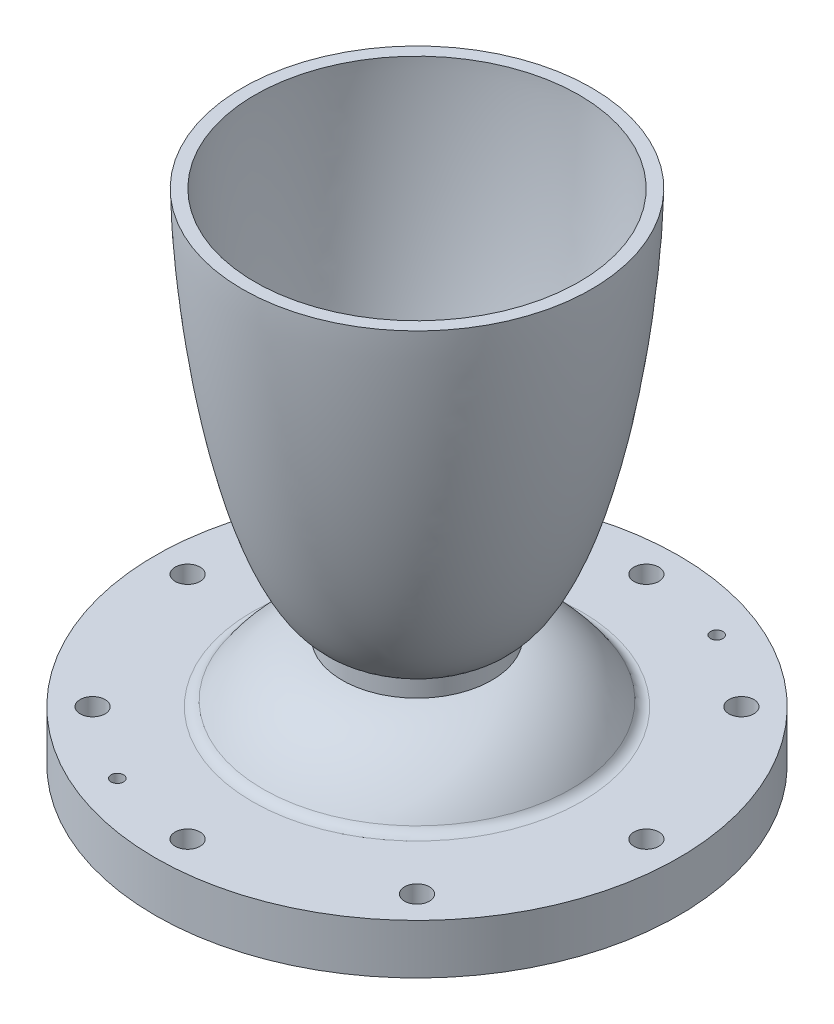
ISO-10303-21;
HEADER;
FILE_DESCRIPTION(('STEP AP214'),'2;1');
FILE_NAME('part.step','',(''),(''),'','','');
FILE_SCHEMA(('AUTOMOTIVE_DESIGN { 1 0 10303 214 1 1 1 1 }'));
ENDSEC;
DATA;
#1=APPLICATION_CONTEXT('core data for automotive mechanical design processes');
#2=APPLICATION_PROTOCOL_DEFINITION('international standard','automotive_design',2000,#1);
#3=PRODUCT_CONTEXT('',#1,'mechanical');
#4=PRODUCT('Part','Part','',(#3));
#5=PRODUCT_RELATED_PRODUCT_CATEGORY('part','',(#4));
#6=PRODUCT_DEFINITION_FORMATION('','',#4);
#7=PRODUCT_DEFINITION_CONTEXT('part definition',#1,'design');
#8=PRODUCT_DEFINITION('design','',#6,#7);
#9=PRODUCT_DEFINITION_SHAPE('','',#8);
#10=(LENGTH_UNIT() NAMED_UNIT(*) SI_UNIT(.MILLI.,.METRE.));
#11=(NAMED_UNIT(*) PLANE_ANGLE_UNIT() SI_UNIT($,.RADIAN.));
#12=(NAMED_UNIT(*) SI_UNIT($,.STERADIAN.) SOLID_ANGLE_UNIT());
#13=UNCERTAINTY_MEASURE_WITH_UNIT(LENGTH_MEASURE(1.E-05),#10,'distance_accuracy_value','');
#14=(GEOMETRIC_REPRESENTATION_CONTEXT(3) GLOBAL_UNCERTAINTY_ASSIGNED_CONTEXT((#13)) GLOBAL_UNIT_ASSIGNED_CONTEXT((#10,
#11,#12)) REPRESENTATION_CONTEXT('',''));
#15=CARTESIAN_POINT('',(0.,0.,0.));
#16=DIRECTION('',(0.,0.,1.));
#17=DIRECTION('',(1.,0.,0.));
#18=AXIS2_PLACEMENT_3D('',#15,#16,#17);
#19=CARTESIAN_POINT('',(-66.675,12.7,0.));
#20=DIRECTION('',(0.,-1.,0.));
#21=DIRECTION('',(0.,0.,-1.));
#22=AXIS2_PLACEMENT_3D('',#19,#20,#21);
#23=PLANE('',#22);
#24=CARTESIAN_POINT('',(22.3563661187686,12.7,-53.9730422893094));
#25=DIRECTION('',(0.,-1.,0.));
#26=DIRECTION('',(0.,0.,-1.));
#27=AXIS2_PLACEMENT_3D('',#24,#25,#26);
#28=CIRCLE('',#27,1.58750000000001);
#29=CARTESIAN_POINT('',(22.3563661187686,12.7,-55.5605422893094));
#30=VERTEX_POINT('',#29);
#31=EDGE_CURVE('E41',#30,#30,#28,.T.);
#32=ORIENTED_EDGE('',*,*,#31,.T.);
#33=EDGE_LOOP('',(#32));
#34=FACE_BOUND('',#33,.T.);
#35=CARTESIAN_POINT('',(-22.3563661187682,12.7,53.9730422893095));
#36=DIRECTION('',(0.,-1.,0.));
#37=DIRECTION('',(0.,0.,-1.));
#38=AXIS2_PLACEMENT_3D('',#35,#36,#37);
#39=CIRCLE('',#38,1.58750000000001);
#40=CARTESIAN_POINT('',(-22.3563661187682,12.7,52.3855422893095));
#41=VERTEX_POINT('',#40);
#42=EDGE_CURVE('E55',#41,#41,#39,.T.);
#43=ORIENTED_EDGE('',*,*,#42,.T.);
#44=EDGE_LOOP('',(#43));
#45=FACE_BOUND('',#44,.T.);
#46=CARTESIAN_POINT('',(-58.42,12.7,0.));
#47=DIRECTION('',(0.,1.,0.));
#48=DIRECTION('',(0.,0.,1.));
#49=AXIS2_PLACEMENT_3D('',#46,#47,#48);
#50=CIRCLE('',#49,3.175);
#51=CARTESIAN_POINT('',(-58.42,12.7,3.175));
#52=VERTEX_POINT('',#51);
#53=EDGE_CURVE('E58',#52,#52,#50,.T.);
#54=ORIENTED_EDGE('',*,*,#53,.F.);
#55=EDGE_LOOP('',(#54));
#56=FACE_BOUND('',#55,.T.);
#57=CARTESIAN_POINT('',(2.03972339815216E-13,12.7,-58.42));
#58=DIRECTION('',(0.,1.,0.));
#59=DIRECTION('',(0.,0.,1.));
#60=AXIS2_PLACEMENT_3D('',#57,#58,#59);
#61=CIRCLE('',#60,3.175);
#62=CARTESIAN_POINT('',(2.03972339815216E-13,12.7,-55.245));
#63=VERTEX_POINT('',#62);
#64=EDGE_CURVE('E89',#63,#63,#61,.T.);
#65=ORIENTED_EDGE('',*,*,#64,.F.);
#66=EDGE_LOOP('',(#65));
#67=FACE_BOUND('',#66,.T.);
#68=CARTESIAN_POINT('',(41.3091781569183,12.7,-41.3091781569179));
#69=DIRECTION('',(0.,1.,0.));
#70=DIRECTION('',(0.,0.,1.));
#71=AXIS2_PLACEMENT_3D('',#68,#69,#70);
#72=CIRCLE('',#71,3.175);
#73=CARTESIAN_POINT('',(41.3091781569183,12.7,-38.1341781569179));
#74=VERTEX_POINT('',#73);
#75=EDGE_CURVE('E97',#74,#74,#72,.T.);
#76=ORIENTED_EDGE('',*,*,#75,.F.);
#77=EDGE_LOOP('',(#76));
#78=FACE_BOUND('',#77,.T.);
#79=CARTESIAN_POINT('',(58.42,12.7,4.07944679630432E-13));
#80=DIRECTION('',(0.,1.,0.));
#81=DIRECTION('',(0.,0.,1.));
#82=AXIS2_PLACEMENT_3D('',#79,#80,#81);
#83=CIRCLE('',#82,3.175);
#84=CARTESIAN_POINT('',(58.42,12.7,3.17500000000041));
#85=VERTEX_POINT('',#84);
#86=EDGE_CURVE('E105',#85,#85,#83,.T.);
#87=ORIENTED_EDGE('',*,*,#86,.F.);
#88=EDGE_LOOP('',(#87));
#89=FACE_BOUND('',#88,.T.);
#90=CARTESIAN_POINT('',(41.3091781569178,12.7,41.3091781569185));
#91=DIRECTION('',(0.,1.,0.));
#92=DIRECTION('',(0.,0.,1.));
#93=AXIS2_PLACEMENT_3D('',#90,#91,#92);
#94=CIRCLE('',#93,3.175);
#95=CARTESIAN_POINT('',(41.3091781569178,12.7,44.4841781569185));
#96=VERTEX_POINT('',#95);
#97=EDGE_CURVE('E113',#96,#96,#94,.T.);
#98=ORIENTED_EDGE('',*,*,#97,.F.);
#99=EDGE_LOOP('',(#98));
#100=FACE_BOUND('',#99,.T.);
#101=CARTESIAN_POINT('',(-6.11917019445648E-13,12.7,58.42));
#102=DIRECTION('',(0.,1.,0.));
#103=DIRECTION('',(0.,0.,1.));
#104=AXIS2_PLACEMENT_3D('',#101,#102,#103);
#105=CIRCLE('',#104,3.175);
#106=CARTESIAN_POINT('',(-6.11917019445648E-13,12.7,61.595));
#107=VERTEX_POINT('',#106);
#108=EDGE_CURVE('E121',#107,#107,#105,.T.);
#109=ORIENTED_EDGE('',*,*,#108,.F.);
#110=EDGE_LOOP('',(#109));
#111=FACE_BOUND('',#110,.T.);
#112=CARTESIAN_POINT('',(-41.3091781569186,12.7,41.3091781569176));
#113=DIRECTION('',(0.,1.,0.));
#114=DIRECTION('',(0.,0.,1.));
#115=AXIS2_PLACEMENT_3D('',#112,#113,#114);
#116=CIRCLE('',#115,3.175);
#117=CARTESIAN_POINT('',(-41.3091781569186,12.7,44.4841781569176));
#118=VERTEX_POINT('',#117);
#119=EDGE_CURVE('E129',#118,#118,#116,.T.);
#120=ORIENTED_EDGE('',*,*,#119,.F.);
#121=EDGE_LOOP('',(#120));
#122=FACE_BOUND('',#121,.T.);
#123=CARTESIAN_POINT('',(0.,12.7,0.));
#124=DIRECTION('',(0.,-1.,0.));
#125=DIRECTION('',(0.,0.,-1.));
#126=AXIS2_PLACEMENT_3D('',#123,#124,#125);
#127=CIRCLE('',#126,41.9100159083325);
#128=CARTESIAN_POINT('',(0.,12.7,-41.9100159083325));
#129=VERTEX_POINT('',#128);
#130=EDGE_CURVE('E46',#129,#129,#127,.T.);
#131=ORIENTED_EDGE('',*,*,#130,.T.);
#132=EDGE_LOOP('',(#131));
#133=FACE_BOUND('',#132,.T.);
#134=CARTESIAN_POINT('',(0.,12.7,0.));
#135=DIRECTION('',(0.,-1.,0.));
#136=DIRECTION('',(0.,0.,-1.));
#137=AXIS2_PLACEMENT_3D('',#134,#135,#136);
#138=CIRCLE('',#137,66.675);
#139=CARTESIAN_POINT('',(0.,12.7,-66.675));
#140=VERTEX_POINT('',#139);
#141=EDGE_CURVE('E217',#140,#140,#138,.T.);
#142=ORIENTED_EDGE('',*,*,#141,.F.);
#143=EDGE_LOOP('',(#142));
#144=FACE_BOUND('',#143,.T.);
#145=CARTESIAN_POINT('',(-41.309178156918,12.7,-41.3091781569182));
#146=DIRECTION('',(0.,1.,0.));
#147=DIRECTION('',(0.,0.,1.));
#148=AXIS2_PLACEMENT_3D('',#145,#146,#147);
#149=CIRCLE('',#148,3.175);
#150=CARTESIAN_POINT('',(-41.309178156918,12.7,-38.1341781569182));
#151=VERTEX_POINT('',#150);
#152=EDGE_CURVE('E81',#151,#151,#149,.T.);
#153=ORIENTED_EDGE('',*,*,#152,.F.);
#154=EDGE_LOOP('',(#153));
#155=FACE_BOUND('',#154,.T.);
#156=ADVANCED_FACE('F37',(#34,#45,#56,#67,#78,#89,#100,#111,#122,#133,#144,#155),#23,.F.);
#157=CARTESIAN_POINT('',(0.,29.8542641397743,0.));
#158=DIRECTION('',(0.,-1.,0.));
#159=DIRECTION('',(0.,0.,-1.));
#160=AXIS2_PLACEMENT_3D('',#157,#158,#159);
#161=TOROIDAL_SURFACE('',#160,14.2803848547379,4.7625);
#162=CARTESIAN_POINT('',(0.,29.8542641397743,0.));
#163=DIRECTION('',(0.,-1.,0.));
#164=DIRECTION('',(0.,0.,-1.));
#165=AXIS2_PLACEMENT_3D('',#162,#163,#164);
#166=CIRCLE('',#165,9.51788485473788);
#167=CARTESIAN_POINT('',(0.,29.8542641397743,-9.51788485473788));
#168=VERTEX_POINT('',#167);
#169=EDGE_CURVE('E137',#168,#168,#166,.T.);
#170=ORIENTED_EDGE('',*,*,#169,.F.);
#171=EDGE_LOOP('',(#170));
#172=FACE_BOUND('',#171,.T.);
#173=CARTESIAN_POINT('',(0.,25.1315262063773,0.));
#174=DIRECTION('',(0.,-1.,0.));
#175=DIRECTION('',(0.,0.,-1.));
#176=AXIS2_PLACEMENT_3D('',#173,#174,#175);
#177=CIRCLE('',#176,13.666257288323);
#178=CARTESIAN_POINT('',(0.,25.1315262063773,-13.666257288323));
#179=VERTEX_POINT('',#178);
#180=EDGE_CURVE('E52',#179,#179,#177,.T.);
#181=ORIENTED_EDGE('',*,*,#180,.T.);
#182=EDGE_LOOP('',(#181));
#183=FACE_BOUND('',#182,.T.);
#184=ADVANCED_FACE('F194',(#172,#183),#161,.T.);
#185=CARTESIAN_POINT('',(-41.275,0.,0.));
#186=CARTESIAN_POINT('',(-41.2740482695217,0.0486337324386472,0.));
#187=CARTESIAN_POINT('',(-41.2702658160628,0.145822286289916,0.));
#188=CARTESIAN_POINT('',(-41.2498864286849,0.42069805070654,0.));
#189=CARTESIAN_POINT('',(-41.1844545380993,0.952068232417223,0.));
#190=CARTESIAN_POINT('',(-41.0456972319703,1.71822600495707,0.));
#191=CARTESIAN_POINT('',(-40.8030503882331,2.71061582436616,0.));
#192=CARTESIAN_POINT('',(-40.4713595142758,3.79591999168736,0.));
#193=CARTESIAN_POINT('',(-40.0738634411657,4.89282909417258,0.));
#194=CARTESIAN_POINT('',(-39.5825067896802,6.07481266261933,0.));
#195=CARTESIAN_POINT('',(-38.9093304891603,7.49520986042452,0.));
#196=CARTESIAN_POINT('',(-38.0131760324094,9.12980259281523,0.));
#197=CARTESIAN_POINT('',(-36.8509904587546,10.9460362971627,0.));
#198=CARTESIAN_POINT('',(-35.4547421274325,12.8169212480345,0.));
#199=CARTESIAN_POINT('',(-33.9314392187202,14.585782904275,0.));
#200=CARTESIAN_POINT('',(-32.2903839047085,16.2459191467967,0.));
#201=CARTESIAN_POINT('',(-30.5400711601419,17.790421622529,0.));
#202=CARTESIAN_POINT('',(-28.6887326358713,19.2122512067634,0.));
#203=CARTESIAN_POINT('',(-26.7445757643625,20.5043436040328,0.));
#204=CARTESIAN_POINT('',(-24.7162091347765,21.6597343307254,0.));
#205=CARTESIAN_POINT('',(-22.6125023398444,22.6717097728236,0.));
#206=CARTESIAN_POINT('',(-20.4432201113575,23.5339726344523,0.));
#207=CARTESIAN_POINT('',(-18.4962933476153,24.1524674664259,0.));
#208=CARTESIAN_POINT('',(-16.7998864552001,24.5823991503031,0.));
#209=CARTESIAN_POINT('',(-15.5134432636415,24.8436085254731,0.));
#210=CARTESIAN_POINT('',(-14.6581957403054,24.990901268989,0.));
#211=CARTESIAN_POINT('',(-14.0864515766681,25.0751975202173,0.));
#212=CARTESIAN_POINT('',(-13.8044042990146,25.1135620744107,0.));
#213=CARTESIAN_POINT('',(-13.666257288323,25.1315262063773,0.));
#214=B_SPLINE_CURVE_WITH_KNOTS('',4,(#185,#186,#187,#188,#189,#190,#191,#192,#193,#194,#195,
#196,#197,#198,#199,#200,#201,#202,#203,#204,#205,#206,#207,#208,#209,#210,#211,#212,#213),
.UNSPECIFIED.,.F.,.F.,(5,1,1,1,1,1,1,1,1,1,1,1,1,1,1,1,1,1,1,1,1,1,1,1,1,5),(0.,
0.00401484909608226,0.00802969819216452,0.0227470961228314,0.0441777122776176,
0.0682473660350328,0.0923169269059589,0.116386462642345,0.140456137271166,0.173883836801443,
0.222022893633605,0.270162138141272,0.31830113459759,0.366440286525089,0.414579370063091,
0.462718532534819,0.510857613485277,0.558996754784725,0.607135853792004,0.655274937644816,
0.703414058846366,0.751553161907756,0.775622711242062,0.799692260576367,0.811727036760595,
0.823244081799249),.UNSPECIFIED.);
#215=CARTESIAN_POINT('',(0.,0.,0.));
#216=DIRECTION('',(0.,-1.,0.));
#217=AXIS1_PLACEMENT('',#215,#216);
#218=SURFACE_OF_REVOLUTION('',#214,#217);
#219=ORIENTED_EDGE('',*,*,#180,.F.);
#220=EDGE_LOOP('',(#219));
#221=FACE_BOUND('',#220,.T.);
#222=CARTESIAN_POINT('',(0.,0.,0.));
#223=DIRECTION('',(0.,-1.,0.));
#224=DIRECTION('',(0.,0.,-1.));
#225=AXIS2_PLACEMENT_3D('',#222,#223,#224);
#226=CIRCLE('',#225,41.275);
#227=CARTESIAN_POINT('',(0.,0.,-41.275));
#228=VERTEX_POINT('',#227);
#229=EDGE_CURVE('E208',#228,#228,#226,.T.);
#230=ORIENTED_EDGE('',*,*,#229,.T.);
#231=EDGE_LOOP('',(#230));
#232=FACE_BOUND('',#231,.T.);
#233=ADVANCED_FACE('F190',(#221,#232),#218,.T.);
#234=CARTESIAN_POINT('',(-41.275,0.,0.));
#235=DIRECTION('',(0.,1.,0.));
#236=DIRECTION('',(0.,0.,1.));
#237=AXIS2_PLACEMENT_3D('',#234,#235,#236);
#238=PLANE('',#237);
#239=CARTESIAN_POINT('',(22.3563661187686,0.,-53.9730422893094));
#240=DIRECTION('',(0.,-1.,0.));
#241=DIRECTION('',(0.,0.,-1.));
#242=AXIS2_PLACEMENT_3D('',#239,#240,#241);
#243=CIRCLE('',#242,3.17500000000001);
#244=CARTESIAN_POINT('',(22.3563661187686,0.,-57.1480422893094));
#245=VERTEX_POINT('',#244);
#246=EDGE_CURVE('E319',#245,#245,#243,.T.);
#247=ORIENTED_EDGE('',*,*,#246,.F.);
#248=EDGE_LOOP('',(#247));
#249=FACE_BOUND('',#248,.T.);
#250=CARTESIAN_POINT('',(-22.3563661187682,0.,53.9730422893095));
#251=DIRECTION('',(0.,-1.,0.));
#252=DIRECTION('',(0.,0.,-1.));
#253=AXIS2_PLACEMENT_3D('',#250,#251,#252);
#254=CIRCLE('',#253,3.17500000000001);
#255=CARTESIAN_POINT('',(-22.3563661187682,0.,50.7980422893095));
#256=VERTEX_POINT('',#255);
#257=EDGE_CURVE('E74',#256,#256,#254,.T.);
#258=ORIENTED_EDGE('',*,*,#257,.F.);
#259=EDGE_LOOP('',(#258));
#260=FACE_BOUND('',#259,.T.);
#261=CARTESIAN_POINT('',(-58.42,0.,0.));
#262=DIRECTION('',(0.,1.,0.));
#263=DIRECTION('',(0.,0.,1.));
#264=AXIS2_PLACEMENT_3D('',#261,#262,#263);
#265=CIRCLE('',#264,3.175);
#266=CARTESIAN_POINT('',(-58.42,0.,3.175));
#267=VERTEX_POINT('',#266);
#268=EDGE_CURVE('E65',#267,#267,#265,.T.);
#269=ORIENTED_EDGE('',*,*,#268,.T.);
#270=EDGE_LOOP('',(#269));
#271=FACE_BOUND('',#270,.T.);
#272=CARTESIAN_POINT('',(-41.309178156918,0.,-41.3091781569182));
#273=DIRECTION('',(0.,1.,0.));
#274=DIRECTION('',(0.,0.,1.));
#275=AXIS2_PLACEMENT_3D('',#272,#273,#274);
#276=CIRCLE('',#275,3.175);
#277=CARTESIAN_POINT('',(-41.309178156918,0.,-38.1341781569182));
#278=VERTEX_POINT('',#277);
#279=EDGE_CURVE('E85',#278,#278,#276,.T.);
#280=ORIENTED_EDGE('',*,*,#279,.T.);
#281=EDGE_LOOP('',(#280));
#282=FACE_BOUND('',#281,.T.);
#283=CARTESIAN_POINT('',(2.03972339815216E-13,0.,-58.42));
#284=DIRECTION('',(0.,1.,0.));
#285=DIRECTION('',(0.,0.,1.));
#286=AXIS2_PLACEMENT_3D('',#283,#284,#285);
#287=CIRCLE('',#286,3.175);
#288=CARTESIAN_POINT('',(2.03972339815216E-13,0.,-55.245));
#289=VERTEX_POINT('',#288);
#290=EDGE_CURVE('E93',#289,#289,#287,.T.);
#291=ORIENTED_EDGE('',*,*,#290,.T.);
#292=EDGE_LOOP('',(#291));
#293=FACE_BOUND('',#292,.T.);
#294=CARTESIAN_POINT('',(41.3091781569183,0.,-41.3091781569179));
#295=DIRECTION('',(0.,1.,0.));
#296=DIRECTION('',(0.,0.,1.));
#297=AXIS2_PLACEMENT_3D('',#294,#295,#296);
#298=CIRCLE('',#297,3.175);
#299=CARTESIAN_POINT('',(41.3091781569183,0.,-38.1341781569179));
#300=VERTEX_POINT('',#299);
#301=EDGE_CURVE('E101',#300,#300,#298,.T.);
#302=ORIENTED_EDGE('',*,*,#301,.T.);
#303=EDGE_LOOP('',(#302));
#304=FACE_BOUND('',#303,.T.);
#305=CARTESIAN_POINT('',(58.42,0.,4.07944679630432E-13));
#306=DIRECTION('',(0.,1.,0.));
#307=DIRECTION('',(0.,0.,1.));
#308=AXIS2_PLACEMENT_3D('',#305,#306,#307);
#309=CIRCLE('',#308,3.175);
#310=CARTESIAN_POINT('',(58.42,0.,3.17500000000041));
#311=VERTEX_POINT('',#310);
#312=EDGE_CURVE('E109',#311,#311,#309,.T.);
#313=ORIENTED_EDGE('',*,*,#312,.T.);
#314=EDGE_LOOP('',(#313));
#315=FACE_BOUND('',#314,.T.);
#316=CARTESIAN_POINT('',(41.3091781569178,0.,41.3091781569185));
#317=DIRECTION('',(0.,1.,0.));
#318=DIRECTION('',(0.,0.,1.));
#319=AXIS2_PLACEMENT_3D('',#316,#317,#318);
#320=CIRCLE('',#319,3.175);
#321=CARTESIAN_POINT('',(41.3091781569178,0.,44.4841781569185));
#322=VERTEX_POINT('',#321);
#323=EDGE_CURVE('E117',#322,#322,#320,.T.);
#324=ORIENTED_EDGE('',*,*,#323,.T.);
#325=EDGE_LOOP('',(#324));
#326=FACE_BOUND('',#325,.T.);
#327=CARTESIAN_POINT('',(-6.11917019445648E-13,0.,58.42));
#328=DIRECTION('',(0.,1.,0.));
#329=DIRECTION('',(0.,0.,1.));
#330=AXIS2_PLACEMENT_3D('',#327,#328,#329);
#331=CIRCLE('',#330,3.175);
#332=CARTESIAN_POINT('',(-6.11917019445648E-13,0.,61.595));
#333=VERTEX_POINT('',#332);
#334=EDGE_CURVE('E125',#333,#333,#331,.T.);
#335=ORIENTED_EDGE('',*,*,#334,.T.);
#336=EDGE_LOOP('',(#335));
#337=FACE_BOUND('',#336,.T.);
#338=CARTESIAN_POINT('',(-41.3091781569186,0.,41.3091781569176));
#339=DIRECTION('',(0.,1.,0.));
#340=DIRECTION('',(0.,0.,1.));
#341=AXIS2_PLACEMENT_3D('',#338,#339,#340);
#342=CIRCLE('',#341,3.175);
#343=CARTESIAN_POINT('',(-41.3091781569186,0.,44.4841781569176));
#344=VERTEX_POINT('',#343);
#345=EDGE_CURVE('E133',#344,#344,#342,.T.);
#346=ORIENTED_EDGE('',*,*,#345,.T.);
#347=EDGE_LOOP('',(#346));
#348=FACE_BOUND('',#347,.T.);
#349=ORIENTED_EDGE('',*,*,#229,.F.);
#350=EDGE_LOOP('',(#349));
#351=FACE_BOUND('',#350,.T.);
#352=CARTESIAN_POINT('',(0.,0.,0.));
#353=DIRECTION('',(0.,-1.,0.));
#354=DIRECTION('',(0.,0.,-1.));
#355=AXIS2_PLACEMENT_3D('',#352,#353,#354);
#356=CIRCLE('',#355,66.675);
#357=CARTESIAN_POINT('',(0.,0.,-66.675));
#358=VERTEX_POINT('',#357);
#359=EDGE_CURVE('E211',#358,#358,#356,.T.);
#360=ORIENTED_EDGE('',*,*,#359,.T.);
#361=EDGE_LOOP('',(#360));
#362=FACE_BOUND('',#361,.T.);
#363=ADVANCED_FACE('F193',(#249,#260,#271,#282,#293,#304,#315,#326,#337,#348,#351,#362),#238,.F.);
#364=CARTESIAN_POINT('',(0.,0.,0.));
#365=DIRECTION('',(0.,-1.,0.));
#366=DIRECTION('',(0.,0.,-1.));
#367=AXIS2_PLACEMENT_3D('',#364,#365,#366);
#368=CYLINDRICAL_SURFACE('',#367,66.675);
#369=ORIENTED_EDGE('',*,*,#359,.F.);
#370=EDGE_LOOP('',(#369));
#371=FACE_BOUND('',#370,.T.);
#372=ORIENTED_EDGE('',*,*,#141,.T.);
#373=EDGE_LOOP('',(#372));
#374=FACE_BOUND('',#373,.T.);
#375=ADVANCED_FACE('F172',(#371,#374),#368,.T.);
#376=CARTESIAN_POINT('',(-19.0499999986131,28.0420867264612,0.));
#377=CARTESIAN_POINT('',(-19.0805977547271,28.0379156616325,0.));
#378=CARTESIAN_POINT('',(-19.4488033775693,27.9870306938501,0.));
#379=CARTESIAN_POINT('',(-20.1468507701769,27.8746807320263,0.));
#380=CARTESIAN_POINT('',(-21.1925623240709,27.6670644242806,0.));
#381=CARTESIAN_POINT('',(-22.5078814737305,27.3232359501129,0.));
#382=CARTESIAN_POINT('',(-23.8141232897541,26.9067389280959,0.));
#383=CARTESIAN_POINT('',(-25.088892974973,26.4203879510294,0.));
#384=CARTESIAN_POINT('',(-26.3894002189404,25.845449005418,0.));
#385=CARTESIAN_POINT('',(-27.9592301864375,25.0460299127044,0.));
#386=CARTESIAN_POINT('',(-29.7655993530124,23.9638389209906,0.));
#387=CARTESIAN_POINT('',(-31.7552930221634,22.5381712215254,0.));
#388=CARTESIAN_POINT('',(-33.8283628137367,20.7528749319911,0.));
#389=CARTESIAN_POINT('',(-35.7432763251375,18.7998083824994,0.));
#390=CARTESIAN_POINT('',(-37.4963912198687,16.7004653617192,0.));
#391=CARTESIAN_POINT('',(-38.7877306915105,14.8891079170873,0.));
#392=CARTESIAN_POINT('',(-39.6106341101488,13.5873662110573,0.));
#393=CARTESIAN_POINT('',(-40.0458000842423,12.8497956410024,0.));
#394=CARTESIAN_POINT('',(-40.1329303269366,12.7,0.));
#395=B_SPLINE_CURVE_WITH_KNOTS('',4,(#376,#377,#378,#379,#380,#381,#382,#383,#384,#385,#386,
#387,#388,#389,#390,#391,#392,#393,#394),.UNSPECIFIED.,.F.,.F.,(5,1,1,1,1,1,1,1,1,1,1,1,1,1,1,
5),(0.28137844721642,0.283951761266025,0.312375768854541,0.340799780433895,0.369223803645126,
0.397647807174526,0.426071825413897,0.454495850010654,0.487403075049432,0.544251108132712,
0.601099130710495,0.657947177199895,0.714795224633917,0.771643196489256,0.828491332262036,
0.842913614908002),.UNSPECIFIED.);
#396=CARTESIAN_POINT('',(0.,0.,0.));
#397=DIRECTION('',(0.,-1.,0.));
#398=AXIS1_PLACEMENT('',#396,#397);
#399=SURFACE_OF_REVOLUTION('',#395,#398);
#400=CARTESIAN_POINT('',(0.,14.1541715341017,0.));
#401=DIRECTION('',(0.,-1.,0.));
#402=DIRECTION('',(0.,0.,-1.));
#403=AXIS2_PLACEMENT_3D('',#400,#401,#402);
#404=CIRCLE('',#403,39.2418003265336);
#405=CARTESIAN_POINT('',(0.,14.1541715341017,-39.2418003265336));
#406=VERTEX_POINT('',#405);
#407=EDGE_CURVE('E10',#406,#406,#404,.F.);
#408=ORIENTED_EDGE('',*,*,#407,.T.);
#409=EDGE_LOOP('',(#408));
#410=FACE_BOUND('',#409,.T.);
#411=CARTESIAN_POINT('',(0.,28.0420867264611,0.));
#412=DIRECTION('',(0.,-1.,0.));
#413=DIRECTION('',(0.,0.,-1.));
#414=AXIS2_PLACEMENT_3D('',#411,#412,#413);
#415=CIRCLE('',#414,19.0499999986137);
#416=CARTESIAN_POINT('',(0.,28.0420867264611,-19.0499999986137));
#417=VERTEX_POINT('',#416);
#418=EDGE_CURVE('E221',#417,#417,#415,.T.);
#419=ORIENTED_EDGE('',*,*,#418,.T.);
#420=EDGE_LOOP('',(#419));
#421=FACE_BOUND('',#420,.T.);
#422=ADVANCED_FACE('F168',(#410,#421),#399,.T.);
#423=CARTESIAN_POINT('',(0.,0.,0.));
#424=DIRECTION('',(0.,-1.,0.));
#425=DIRECTION('',(0.,0.,-1.));
#426=AXIS2_PLACEMENT_3D('',#423,#424,#425);
#427=CYLINDRICAL_SURFACE('',#426,19.0499999993164);
#428=ORIENTED_EDGE('',*,*,#418,.F.);
#429=EDGE_LOOP('',(#428));
#430=FACE_BOUND('',#429,.T.);
#431=CARTESIAN_POINT('',(0.,32.477251840364,0.));
#432=DIRECTION('',(0.,-1.,0.));
#433=DIRECTION('',(0.,0.,-1.));
#434=AXIS2_PLACEMENT_3D('',#431,#432,#433);
#435=CIRCLE('',#434,19.0500000000192);
#436=CARTESIAN_POINT('',(0.,32.477251840364,-19.0500000000192));
#437=VERTEX_POINT('',#436);
#438=EDGE_CURVE('E225',#437,#437,#435,.T.);
#439=ORIENTED_EDGE('',*,*,#438,.T.);
#440=EDGE_LOOP('',(#439));
#441=FACE_BOUND('',#440,.T.);
#442=ADVANCED_FACE('F164',(#430,#441),#427,.T.);
#443=CARTESIAN_POINT('',(-44.4499999994619,127.,0.));
#444=CARTESIAN_POINT('',(-44.4440480949627,126.089867785625,0.));
#445=CARTESIAN_POINT('',(-44.3997234937456,124.270031310633,0.));
#446=CARTESIAN_POINT('',(-44.2561708348068,120.604636061883,0.));
#447=CARTESIAN_POINT('',(-43.9212069727933,115.098603124568,0.));
#448=CARTESIAN_POINT('',(-43.3950463606768,108.666141992639,0.));
#449=CARTESIAN_POINT('',(-42.6246446121031,101.314791697914,0.));
#450=CARTESIAN_POINT('',(-41.6911594682795,93.9823600996109,0.));
#451=CARTESIAN_POINT('',(-40.5889041011441,86.6733392574783,0.));
#452=CARTESIAN_POINT('',(-39.3055204834889,79.3937386890904,0.));
#453=CARTESIAN_POINT('',(-37.8196170375013,72.152599105172,0.));
#454=CARTESIAN_POINT('',(-36.0988903282507,64.9630070237046,0.));
#455=CARTESIAN_POINT('',(-34.092981801623,57.8470820320063,0.));
#456=CARTESIAN_POINT('',(-31.7661981405824,50.9720173809853,0.));
#457=CARTESIAN_POINT('',(-29.3150373471858,45.1286490762413,0.));
#458=CARTESIAN_POINT('',(-26.8381389868326,40.4693278183936,0.));
#459=CARTESIAN_POINT('',(-24.5703302650785,37.1782514550421,0.));
#460=CARTESIAN_POINT('',(-22.7831204154743,35.1329736574909,0.));
#461=CARTESIAN_POINT('',(-21.3073007985053,33.8364878019842,0.));
#462=CARTESIAN_POINT('',(-20.194653885228,33.0747827719268,0.));
#463=CARTESIAN_POINT('',(-19.5152952812364,32.7004663944373,0.));
#464=CARTESIAN_POINT('',(-19.2057724197125,32.548791320822,0.));
#465=CARTESIAN_POINT('',(-19.0500000000192,32.477251840364,0.));
#466=B_SPLINE_CURVE_WITH_KNOTS('',4,(#443,#444,#445,#446,#447,#448,#449,#450,#451,#452,#453,
#454,#455,#456,#457,#458,#459,#460,#461,#462,#463,#464,#465),.UNSPECIFIED.,.F.,.F.,(5,1,1,1,1,1,
1,1,1,1,1,1,1,1,1,1,1,1,1,5),(0.,0.0331608081218559,0.0663216162437117,0.13364469557757,
0.200967790308634,0.268290787447395,0.33561384231508,0.402936930100839,0.470260007312255,
0.537583094276509,0.60490613878835,0.672229114484928,0.739552316261651,0.801869766015148,
0.835531618042228,0.864104380029788,0.884897619658436,0.900577549119469,0.906888404227075,
0.913134212312117),.UNSPECIFIED.);
#467=CARTESIAN_POINT('',(0.,0.,0.));
#468=DIRECTION('',(0.,-1.,0.));
#469=AXIS1_PLACEMENT('',#467,#468);
#470=SURFACE_OF_REVOLUTION('',#466,#469);
#471=ORIENTED_EDGE('',*,*,#438,.F.);
#472=EDGE_LOOP('',(#471));
#473=FACE_BOUND('',#472,.T.);
#474=CARTESIAN_POINT('',(0.,127.,0.));
#475=DIRECTION('',(0.,-1.,0.));
#476=DIRECTION('',(0.,0.,-1.));
#477=AXIS2_PLACEMENT_3D('',#474,#475,#476);
#478=CIRCLE('',#477,44.449999999462);
#479=CARTESIAN_POINT('',(0.,127.,-44.449999999462));
#480=VERTEX_POINT('',#479);
#481=EDGE_CURVE('E229',#480,#480,#478,.T.);
#482=ORIENTED_EDGE('',*,*,#481,.T.);
#483=EDGE_LOOP('',(#482));
#484=FACE_BOUND('',#483,.T.);
#485=ADVANCED_FACE('F160',(#473,#484),#470,.T.);
#486=CARTESIAN_POINT('',(-44.449999999462,127.,0.));
#487=DIRECTION('',(0.,-1.,0.));
#488=DIRECTION('',(0.,0.,-1.));
#489=AXIS2_PLACEMENT_3D('',#486,#487,#488);
#490=PLANE('',#489);
#491=ORIENTED_EDGE('',*,*,#481,.F.);
#492=EDGE_LOOP('',(#491));
#493=FACE_BOUND('',#492,.T.);
#494=CARTESIAN_POINT('',(0.,127.,0.));
#495=DIRECTION('',(0.,-1.,0.));
#496=DIRECTION('',(0.,0.,-1.));
#497=AXIS2_PLACEMENT_3D('',#494,#495,#496);
#498=CIRCLE('',#497,41.275);
#499=CARTESIAN_POINT('',(0.,127.,-41.275));
#500=VERTEX_POINT('',#499);
#501=EDGE_CURVE('E233',#500,#500,#498,.T.);
#502=ORIENTED_EDGE('',*,*,#501,.T.);
#503=EDGE_LOOP('',(#502));
#504=FACE_BOUND('',#503,.T.);
#505=ADVANCED_FACE('F155',(#493,#504),#490,.F.);
#506=CARTESIAN_POINT('',(-12.6773409556318,35.4889198187523,0.));
#507=CARTESIAN_POINT('',(-12.7732848592656,35.5232154561329,0.));
#508=CARTESIAN_POINT('',(-13.0375647621944,35.6215562004272,0.));
#509=CARTESIAN_POINT('',(-13.4647754627408,35.797858298487,0.));
#510=CARTESIAN_POINT('',(-14.0774164435609,36.0904916639894,0.));
#511=CARTESIAN_POINT('',(-14.7707294102384,36.4765377319897,0.));
#512=CARTESIAN_POINT('',(-15.7468622587249,37.1002174776773,0.));
#513=CARTESIAN_POINT('',(-17.0528319827198,38.1035395787502,0.));
#514=CARTESIAN_POINT('',(-18.7203178430293,39.6859165032633,0.));
#515=CARTESIAN_POINT('',(-20.7112098452496,42.0554981742865,0.));
#516=CARTESIAN_POINT('',(-23.1258342222305,45.5925436415,0.));
#517=CARTESIAN_POINT('',(-25.6831407827854,50.291800129597,0.));
#518=CARTESIAN_POINT('',(-28.1912692207761,55.9763831267094,0.));
#519=CARTESIAN_POINT('',(-30.5585169708021,62.4907579566963,0.));
#520=CARTESIAN_POINT('',(-32.5938073550281,69.1145502440156,0.));
#521=CARTESIAN_POINT('',(-34.3591237402991,75.8147735578479,0.));
#522=CARTESIAN_POINT('',(-35.8956312407358,82.5706199688914,0.));
#523=CARTESIAN_POINT('',(-37.2305702212177,89.368983138702,0.));
#524=CARTESIAN_POINT('',(-38.3822278625073,96.2006167737801,0.));
#525=CARTESIAN_POINT('',(-39.3608494636477,103.05910618467,0.));
#526=CARTESIAN_POINT('',(-40.1704674223054,109.939618965182,0.));
#527=CARTESIAN_POINT('',(-40.7227860846152,115.949040077317,0.));
#528=CARTESIAN_POINT('',(-41.0733691261886,121.078528781532,0.));
#529=CARTESIAN_POINT('',(-41.2229977057739,124.484568363418,0.));
#530=CARTESIAN_POINT('',(-41.2688730363136,126.161357832939,0.));
#531=CARTESIAN_POINT('',(-41.275,127.,0.));
#532=B_SPLINE_CURVE_WITH_KNOTS('',4,(#506,#507,#508,#509,#510,#511,#512,#513,#514,#515,#516,
#517,#518,#519,#520,#521,#522,#523,#524,#525,#526,#527,#528,#529,#530,#531),.UNSPECIFIED.,.F.,
.F.,(5,1,1,1,1,1,1,1,1,1,1,1,1,1,1,1,1,1,1,1,1,1,5),(0.,0.00374307995331247,0.0103584655181561,
0.0169738510829998,0.0249271942175395,0.0328805373520792,0.0528892136881201,0.0773816429618902,
0.10919472490756,0.146374270074533,0.210001175516254,0.273627892657264,0.337254754330257,
0.400881621075781,0.464508471937456,0.528135328570352,0.591762176390416,0.655389059707643,
0.719015710883957,0.782642537527227,0.84626947354136,0.877081130050798,0.907892786560235),.UNSPECIFIED.);
#533=CARTESIAN_POINT('',(0.,0.,0.));
#534=DIRECTION('',(0.,-1.,0.));
#535=AXIS1_PLACEMENT('',#533,#534);
#536=SURFACE_OF_REVOLUTION('',#532,#535);
#537=ORIENTED_EDGE('',*,*,#501,.F.);
#538=EDGE_LOOP('',(#537));
#539=FACE_BOUND('',#538,.T.);
#540=CARTESIAN_POINT('',(0.,35.4889198187522,0.));
#541=DIRECTION('',(0.,-1.,0.));
#542=DIRECTION('',(0.,0.,-1.));
#543=AXIS2_PLACEMENT_3D('',#540,#541,#542);
#544=CIRCLE('',#543,12.6773409556317);
#545=CARTESIAN_POINT('',(0.,35.4889198187522,-12.6773409556317));
#546=VERTEX_POINT('',#545);
#547=EDGE_CURVE('E237',#546,#546,#544,.T.);
#548=ORIENTED_EDGE('',*,*,#547,.T.);
#549=EDGE_LOOP('',(#548));
#550=FACE_BOUND('',#549,.T.);
#551=ADVANCED_FACE('F150',(#539,#550),#536,.T.);
#552=CARTESIAN_POINT('',(0.,31.0043176616441,0.));
#553=DIRECTION('',(0.,-1.,0.));
#554=DIRECTION('',(0.,0.,-1.));
#555=AXIS2_PLACEMENT_3D('',#552,#553,#554);
#556=TOROIDAL_SURFACE('',#555,14.2803848547379,4.76250000000001);
#557=ORIENTED_EDGE('',*,*,#547,.F.);
#558=EDGE_LOOP('',(#557));
#559=FACE_BOUND('',#558,.T.);
#560=CARTESIAN_POINT('',(0.,31.0043176616441,0.));
#561=DIRECTION('',(0.,-1.,0.));
#562=DIRECTION('',(0.,0.,-1.));
#563=AXIS2_PLACEMENT_3D('',#560,#561,#562);
#564=CIRCLE('',#563,9.51788485473788);
#565=CARTESIAN_POINT('',(0.,31.0043176616441,-9.51788485473788));
#566=VERTEX_POINT('',#565);
#567=EDGE_CURVE('E240',#566,#566,#564,.T.);
#568=ORIENTED_EDGE('',*,*,#567,.T.);
#569=EDGE_LOOP('',(#568));
#570=FACE_BOUND('',#569,.T.);
#571=ADVANCED_FACE('F154',(#559,#570),#556,.T.);
#572=CARTESIAN_POINT('',(0.,0.,0.));
#573=DIRECTION('',(0.,-1.,0.));
#574=DIRECTION('',(0.,0.,-1.));
#575=AXIS2_PLACEMENT_3D('',#572,#573,#574);
#576=CYLINDRICAL_SURFACE('',#575,9.51788485473788);
#577=ORIENTED_EDGE('',*,*,#567,.F.);
#578=EDGE_LOOP('',(#577));
#579=FACE_BOUND('',#578,.T.);
#580=ORIENTED_EDGE('',*,*,#169,.T.);
#581=EDGE_LOOP('',(#580));
#582=FACE_BOUND('',#581,.T.);
#583=ADVANCED_FACE('F247',(#579,#582),#576,.F.);
#584=CARTESIAN_POINT('',(0.,15.8749999999999,0.));
#585=DIRECTION('',(0.,-1.,0.));
#586=DIRECTION('',(0.,0.,-1.));
#587=AXIS2_PLACEMENT_3D('',#584,#585,#586);
#588=TOROIDAL_SURFACE('',#587,41.9100159083325,3.175);
#589=ORIENTED_EDGE('',*,*,#407,.F.);
#590=EDGE_LOOP('',(#589));
#591=FACE_BOUND('',#590,.T.);
#592=ORIENTED_EDGE('',*,*,#130,.F.);
#593=EDGE_LOOP('',(#592));
#594=FACE_BOUND('',#593,.T.);
#595=ADVANCED_FACE('F39',(#591,#594),#588,.F.);
#596=CARTESIAN_POINT('',(-41.3091781569186,12.7,41.3091781569176));
#597=DIRECTION('',(0.,1.,0.));
#598=DIRECTION('',(0.,0.,1.));
#599=AXIS2_PLACEMENT_3D('',#596,#597,#598);
#600=CYLINDRICAL_SURFACE('',#599,3.175);
#601=ORIENTED_EDGE('',*,*,#345,.F.);
#602=EDGE_LOOP('',(#601));
#603=FACE_BOUND('',#602,.T.);
#604=ORIENTED_EDGE('',*,*,#119,.T.);
#605=EDGE_LOOP('',(#604));
#606=FACE_BOUND('',#605,.T.);
#607=ADVANCED_FACE('F254',(#603,#606),#600,.F.);
#608=CARTESIAN_POINT('',(-6.11917019445648E-13,12.7,58.42));
#609=DIRECTION('',(0.,1.,0.));
#610=DIRECTION('',(0.,0.,1.));
#611=AXIS2_PLACEMENT_3D('',#608,#609,#610);
#612=CYLINDRICAL_SURFACE('',#611,3.175);
#613=ORIENTED_EDGE('',*,*,#334,.F.);
#614=EDGE_LOOP('',(#613));
#615=FACE_BOUND('',#614,.T.);
#616=ORIENTED_EDGE('',*,*,#108,.T.);
#617=EDGE_LOOP('',(#616));
#618=FACE_BOUND('',#617,.T.);
#619=ADVANCED_FACE('F260',(#615,#618),#612,.F.);
#620=CARTESIAN_POINT('',(41.3091781569178,12.7,41.3091781569185));
#621=DIRECTION('',(0.,1.,0.));
#622=DIRECTION('',(0.,0.,1.));
#623=AXIS2_PLACEMENT_3D('',#620,#621,#622);
#624=CYLINDRICAL_SURFACE('',#623,3.175);
#625=ORIENTED_EDGE('',*,*,#323,.F.);
#626=EDGE_LOOP('',(#625));
#627=FACE_BOUND('',#626,.T.);
#628=ORIENTED_EDGE('',*,*,#97,.T.);
#629=EDGE_LOOP('',(#628));
#630=FACE_BOUND('',#629,.T.);
#631=ADVANCED_FACE('F264',(#627,#630),#624,.F.);
#632=CARTESIAN_POINT('',(58.42,12.7,4.07944679630432E-13));
#633=DIRECTION('',(0.,1.,0.));
#634=DIRECTION('',(0.,0.,1.));
#635=AXIS2_PLACEMENT_3D('',#632,#633,#634);
#636=CYLINDRICAL_SURFACE('',#635,3.175);
#637=ORIENTED_EDGE('',*,*,#312,.F.);
#638=EDGE_LOOP('',(#637));
#639=FACE_BOUND('',#638,.T.);
#640=ORIENTED_EDGE('',*,*,#86,.T.);
#641=EDGE_LOOP('',(#640));
#642=FACE_BOUND('',#641,.T.);
#643=ADVANCED_FACE('F268',(#639,#642),#636,.F.);
#644=CARTESIAN_POINT('',(41.3091781569183,12.7,-41.3091781569179));
#645=DIRECTION('',(0.,1.,0.));
#646=DIRECTION('',(0.,0.,1.));
#647=AXIS2_PLACEMENT_3D('',#644,#645,#646);
#648=CYLINDRICAL_SURFACE('',#647,3.175);
#649=ORIENTED_EDGE('',*,*,#301,.F.);
#650=EDGE_LOOP('',(#649));
#651=FACE_BOUND('',#650,.T.);
#652=ORIENTED_EDGE('',*,*,#75,.T.);
#653=EDGE_LOOP('',(#652));
#654=FACE_BOUND('',#653,.T.);
#655=ADVANCED_FACE('F272',(#651,#654),#648,.F.);
#656=CARTESIAN_POINT('',(2.03972339815216E-13,12.7,-58.42));
#657=DIRECTION('',(0.,1.,0.));
#658=DIRECTION('',(0.,0.,1.));
#659=AXIS2_PLACEMENT_3D('',#656,#657,#658);
#660=CYLINDRICAL_SURFACE('',#659,3.175);
#661=ORIENTED_EDGE('',*,*,#290,.F.);
#662=EDGE_LOOP('',(#661));
#663=FACE_BOUND('',#662,.T.);
#664=ORIENTED_EDGE('',*,*,#64,.T.);
#665=EDGE_LOOP('',(#664));
#666=FACE_BOUND('',#665,.T.);
#667=ADVANCED_FACE('F276',(#663,#666),#660,.F.);
#668=CARTESIAN_POINT('',(-41.309178156918,12.7,-41.3091781569182));
#669=DIRECTION('',(0.,1.,0.));
#670=DIRECTION('',(0.,0.,1.));
#671=AXIS2_PLACEMENT_3D('',#668,#669,#670);
#672=CYLINDRICAL_SURFACE('',#671,3.175);
#673=ORIENTED_EDGE('',*,*,#279,.F.);
#674=EDGE_LOOP('',(#673));
#675=FACE_BOUND('',#674,.T.);
#676=ORIENTED_EDGE('',*,*,#152,.T.);
#677=EDGE_LOOP('',(#676));
#678=FACE_BOUND('',#677,.T.);
#679=ADVANCED_FACE('F280',(#675,#678),#672,.F.);
#680=CARTESIAN_POINT('',(-58.42,12.7,0.));
#681=DIRECTION('',(0.,1.,0.));
#682=DIRECTION('',(0.,0.,1.));
#683=AXIS2_PLACEMENT_3D('',#680,#681,#682);
#684=CYLINDRICAL_SURFACE('',#683,3.175);
#685=ORIENTED_EDGE('',*,*,#268,.F.);
#686=EDGE_LOOP('',(#685));
#687=FACE_BOUND('',#686,.T.);
#688=ORIENTED_EDGE('',*,*,#53,.T.);
#689=EDGE_LOOP('',(#688));
#690=FACE_BOUND('',#689,.T.);
#691=ADVANCED_FACE('F284',(#687,#690),#684,.F.);
#692=CARTESIAN_POINT('',(-22.3563661187682,0.,53.9730422893095));
#693=DIRECTION('',(0.,-1.,0.));
#694=DIRECTION('',(0.,0.,-1.));
#695=AXIS2_PLACEMENT_3D('',#692,#693,#694);
#696=CYLINDRICAL_SURFACE('',#695,1.58750000000001);
#697=CARTESIAN_POINT('',(-22.3563661187682,6.35,53.9730422893095));
#698=DIRECTION('',(0.,-1.,0.));
#699=DIRECTION('',(0.,0.,-1.));
#700=AXIS2_PLACEMENT_3D('',#697,#698,#699);
#701=CIRCLE('',#700,1.58750000000001);
#702=CARTESIAN_POINT('',(-22.3563661187682,6.35,52.3855422893095));
#703=VERTEX_POINT('',#702);
#704=EDGE_CURVE('E59',#703,#703,#701,.T.);
#705=ORIENTED_EDGE('',*,*,#704,.T.);
#706=EDGE_LOOP('',(#705));
#707=FACE_BOUND('',#706,.T.);
#708=ORIENTED_EDGE('',*,*,#42,.F.);
#709=EDGE_LOOP('',(#708));
#710=FACE_BOUND('',#709,.T.);
#711=ADVANCED_FACE('F288',(#707,#710),#696,.F.);
#712=CARTESIAN_POINT('',(-20.7688661187682,6.35,53.9730422893095));
#713=DIRECTION('',(0.,1.,0.));
#714=DIRECTION('',(0.,0.,1.));
#715=AXIS2_PLACEMENT_3D('',#712,#713,#714);
#716=PLANE('',#715);
#717=ORIENTED_EDGE('',*,*,#704,.F.);
#718=EDGE_LOOP('',(#717));
#719=FACE_BOUND('',#718,.T.);
#720=CARTESIAN_POINT('',(-22.3563661187682,6.35,53.9730422893095));
#721=DIRECTION('',(0.,-1.,0.));
#722=DIRECTION('',(0.,0.,-1.));
#723=AXIS2_PLACEMENT_3D('',#720,#721,#722);
#724=CIRCLE('',#723,3.17500000000001);
#725=CARTESIAN_POINT('',(-22.3563661187682,6.35,50.7980422893095));
#726=VERTEX_POINT('',#725);
#727=EDGE_CURVE('E68',#726,#726,#724,.T.);
#728=ORIENTED_EDGE('',*,*,#727,.T.);
#729=EDGE_LOOP('',(#728));
#730=FACE_BOUND('',#729,.T.);
#731=ADVANCED_FACE('F292',(#719,#730),#716,.F.);
#732=CARTESIAN_POINT('',(-22.3563661187682,0.,53.9730422893095));
#733=DIRECTION('',(0.,-1.,0.));
#734=DIRECTION('',(0.,0.,-1.));
#735=AXIS2_PLACEMENT_3D('',#732,#733,#734);
#736=CYLINDRICAL_SURFACE('',#735,3.17500000000001);
#737=ORIENTED_EDGE('',*,*,#727,.F.);
#738=EDGE_LOOP('',(#737));
#739=FACE_BOUND('',#738,.T.);
#740=ORIENTED_EDGE('',*,*,#257,.T.);
#741=EDGE_LOOP('',(#740));
#742=FACE_BOUND('',#741,.T.);
#743=ADVANCED_FACE('F295',(#739,#742),#736,.F.);
#744=CARTESIAN_POINT('',(22.3563661187686,0.,-53.9730422893094));
#745=DIRECTION('',(0.,-1.,0.));
#746=DIRECTION('',(0.,0.,-1.));
#747=AXIS2_PLACEMENT_3D('',#744,#745,#746);
#748=CYLINDRICAL_SURFACE('',#747,1.58750000000001);
#749=CARTESIAN_POINT('',(22.3563661187686,6.35,-53.9730422893094));
#750=DIRECTION('',(0.,-1.,0.));
#751=DIRECTION('',(0.,0.,-1.));
#752=AXIS2_PLACEMENT_3D('',#749,#750,#751);
#753=CIRCLE('',#752,1.58750000000002);
#754=CARTESIAN_POINT('',(22.3563661187686,6.35,-55.5605422893094));
#755=VERTEX_POINT('',#754);
#756=EDGE_CURVE('E324',#755,#755,#753,.T.);
#757=ORIENTED_EDGE('',*,*,#756,.T.);
#758=EDGE_LOOP('',(#757));
#759=FACE_BOUND('',#758,.T.);
#760=ORIENTED_EDGE('',*,*,#31,.F.);
#761=EDGE_LOOP('',(#760));
#762=FACE_BOUND('',#761,.T.);
#763=ADVANCED_FACE('F299',(#759,#762),#748,.F.);
#764=CARTESIAN_POINT('',(23.9438661187686,6.35,-53.9730422893094));
#765=DIRECTION('',(0.,1.,0.));
#766=DIRECTION('',(0.,0.,1.));
#767=AXIS2_PLACEMENT_3D('',#764,#765,#766);
#768=PLANE('',#767);
#769=ORIENTED_EDGE('',*,*,#756,.F.);
#770=EDGE_LOOP('',(#769));
#771=FACE_BOUND('',#770,.T.);
#772=CARTESIAN_POINT('',(22.3563661187686,6.35,-53.9730422893094));
#773=DIRECTION('',(0.,-1.,0.));
#774=DIRECTION('',(0.,0.,-1.));
#775=AXIS2_PLACEMENT_3D('',#772,#773,#774);
#776=CIRCLE('',#775,3.17500000000001);
#777=CARTESIAN_POINT('',(22.3563661187686,6.35,-57.1480422893094));
#778=VERTEX_POINT('',#777);
#779=EDGE_CURVE('E316',#778,#778,#776,.T.);
#780=ORIENTED_EDGE('',*,*,#779,.T.);
#781=EDGE_LOOP('',(#780));
#782=FACE_BOUND('',#781,.T.);
#783=ADVANCED_FACE('F303',(#771,#782),#768,.F.);
#784=CARTESIAN_POINT('',(22.3563661187686,0.,-53.9730422893094));
#785=DIRECTION('',(0.,-1.,0.));
#786=DIRECTION('',(0.,0.,-1.));
#787=AXIS2_PLACEMENT_3D('',#784,#785,#786);
#788=CYLINDRICAL_SURFACE('',#787,3.17500000000001);
#789=ORIENTED_EDGE('',*,*,#779,.F.);
#790=EDGE_LOOP('',(#789));
#791=FACE_BOUND('',#790,.T.);
#792=ORIENTED_EDGE('',*,*,#246,.T.);
#793=EDGE_LOOP('',(#792));
#794=FACE_BOUND('',#793,.T.);
#795=ADVANCED_FACE('F307',(#791,#794),#788,.F.);
#796=CLOSED_SHELL('',(#156,#184,#233,#363,#375,#422,#442,#485,#505,#551,#571,#583,#595,#607,
#619,#631,#643,#655,#667,#679,#691,#711,#731,#743,#763,#783,#795));
#797=MANIFOLD_SOLID_BREP('B2',#796);
#798=ADVANCED_BREP_SHAPE_REPRESENTATION('',(#18,#797),#14);
#799=SHAPE_DEFINITION_REPRESENTATION(#9,#798);
ENDSEC;
END-ISO-10303-21;
